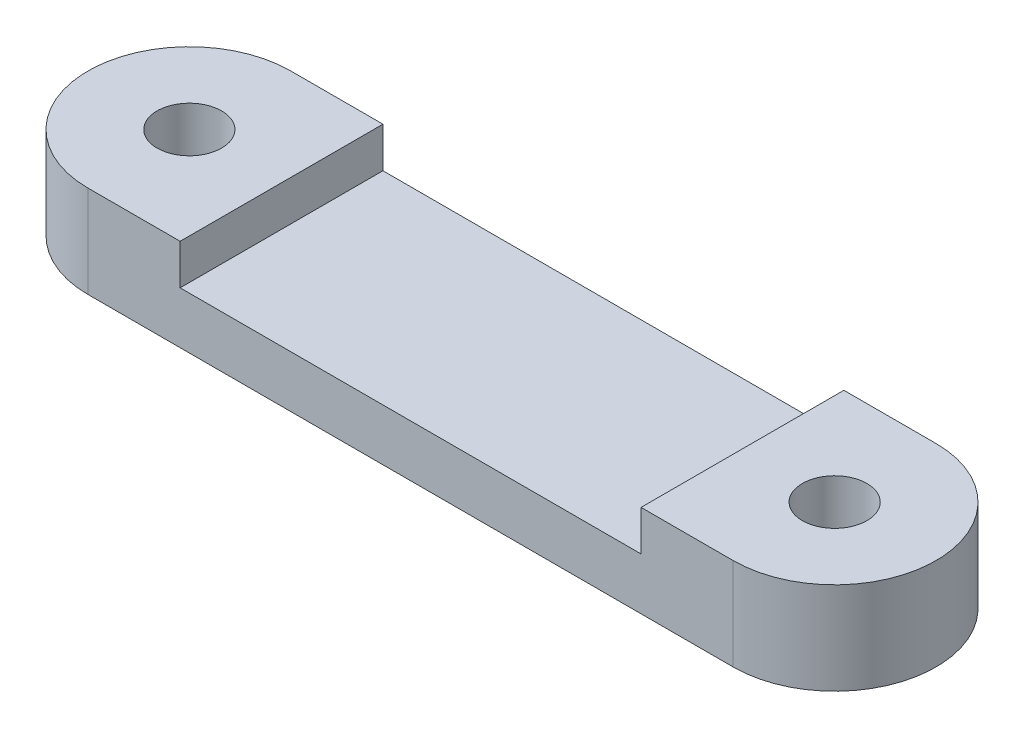
ISO-10303-21;
HEADER;
FILE_DESCRIPTION(('STEP AP214'),'2;1');
FILE_NAME('part.step','',(''),(''),'','','');
FILE_SCHEMA(('AUTOMOTIVE_DESIGN { 1 0 10303 214 1 1 1 1 }'));
ENDSEC;
DATA;
#1=APPLICATION_CONTEXT('core data for automotive mechanical design processes');
#2=APPLICATION_PROTOCOL_DEFINITION('international standard','automotive_design',2000,#1);
#3=PRODUCT_CONTEXT('',#1,'mechanical');
#4=PRODUCT('Part','Part','',(#3));
#5=PRODUCT_RELATED_PRODUCT_CATEGORY('part','',(#4));
#6=PRODUCT_DEFINITION_FORMATION('','',#4);
#7=PRODUCT_DEFINITION_CONTEXT('part definition',#1,'design');
#8=PRODUCT_DEFINITION('design','',#6,#7);
#9=PRODUCT_DEFINITION_SHAPE('','',#8);
#10=(LENGTH_UNIT() NAMED_UNIT(*) SI_UNIT(.MILLI.,.METRE.));
#11=(NAMED_UNIT(*) PLANE_ANGLE_UNIT() SI_UNIT($,.RADIAN.));
#12=(NAMED_UNIT(*) SI_UNIT($,.STERADIAN.) SOLID_ANGLE_UNIT());
#13=UNCERTAINTY_MEASURE_WITH_UNIT(LENGTH_MEASURE(1.E-05),#10,'distance_accuracy_value','');
#14=(GEOMETRIC_REPRESENTATION_CONTEXT(3) GLOBAL_UNCERTAINTY_ASSIGNED_CONTEXT((#13)) GLOBAL_UNIT_ASSIGNED_CONTEXT((#10,
#11,#12)) REPRESENTATION_CONTEXT('',''));
#15=CARTESIAN_POINT('',(0.,0.,0.));
#16=DIRECTION('',(0.,0.,1.));
#17=DIRECTION('',(1.,0.,0.));
#18=AXIS2_PLACEMENT_3D('',#15,#16,#17);
#19=CARTESIAN_POINT('',(0.,4.,-4.4));
#20=DIRECTION('',(0.,1.,0.));
#21=DIRECTION('',(0.,0.,1.));
#22=AXIS2_PLACEMENT_3D('',#19,#20,#21);
#23=PLANE('',#22);
#24=DIRECTION('',(0.,0.,-1.));
#25=VECTOR('',#24,1.);
#26=CARTESIAN_POINT('',(24.,4.,0.));
#27=LINE('',#26,#25);
#28=CARTESIAN_POINT('',(24.,4.,0.));
#29=VERTEX_POINT('',#28);
#30=CARTESIAN_POINT('',(24.,4.,-8.8));
#31=VERTEX_POINT('',#30);
#32=EDGE_CURVE('E186',#29,#31,#27,.T.);
#33=ORIENTED_EDGE('',*,*,#32,.F.);
#34=DIRECTION('',(1.,0.,0.));
#35=VECTOR('',#34,1.);
#36=CARTESIAN_POINT('',(0.,4.,0.));
#37=LINE('',#36,#35);
#38=CARTESIAN_POINT('',(28.,4.,0.));
#39=VERTEX_POINT('',#38);
#40=EDGE_CURVE('E151',#29,#39,#37,.T.);
#41=ORIENTED_EDGE('',*,*,#40,.T.);
#42=CARTESIAN_POINT('',(28.,4.,-4.4));
#43=DIRECTION('',(0.,1.,0.));
#44=DIRECTION('',(0.,0.,-1.));
#45=AXIS2_PLACEMENT_3D('',#42,#43,#44);
#46=CIRCLE('',#45,4.4);
#47=CARTESIAN_POINT('',(28.,4.,-8.8));
#48=VERTEX_POINT('',#47);
#49=EDGE_CURVE('E153',#39,#48,#46,.T.);
#50=ORIENTED_EDGE('',*,*,#49,.T.);
#51=DIRECTION('',(-1.,0.,0.));
#52=VECTOR('',#51,1.);
#53=CARTESIAN_POINT('',(0.,4.,-8.8));
#54=LINE('',#53,#52);
#55=EDGE_CURVE('E155',#48,#31,#54,.T.);
#56=ORIENTED_EDGE('',*,*,#55,.T.);
#57=EDGE_LOOP('',(#33,#41,#50,#56));
#58=FACE_BOUND('',#57,.T.);
#59=CARTESIAN_POINT('',(28.,4.,-4.4));
#60=DIRECTION('',(0.,1.,0.));
#61=DIRECTION('',(0.,0.,1.));
#62=AXIS2_PLACEMENT_3D('',#59,#60,#61);
#63=CIRCLE('',#62,1.4);
#64=CARTESIAN_POINT('',(28.,4.,-3.));
#65=VERTEX_POINT('',#64);
#66=EDGE_CURVE('E136',#65,#65,#63,.T.);
#67=ORIENTED_EDGE('',*,*,#66,.F.);
#68=EDGE_LOOP('',(#67));
#69=FACE_BOUND('',#68,.T.);
#70=ADVANCED_FACE('F39',(#58,#69),#23,.T.);
#71=DIRECTION('',(0.,0.,1.));
#72=VECTOR('',#71,1.);
#73=CARTESIAN_POINT('',(4.,4.,0.));
#74=LINE('',#73,#72);
#75=CARTESIAN_POINT('',(4.,4.,-8.8));
#76=VERTEX_POINT('',#75);
#77=CARTESIAN_POINT('',(4.,4.,0.));
#78=VERTEX_POINT('',#77);
#79=EDGE_CURVE('E185',#76,#78,#74,.T.);
#80=ORIENTED_EDGE('',*,*,#79,.F.);
#81=CARTESIAN_POINT('',(0.,4.,-8.8));
#82=VERTEX_POINT('',#81);
#83=EDGE_CURVE('E63',#76,#82,#54,.T.);
#84=ORIENTED_EDGE('',*,*,#83,.T.);
#85=CARTESIAN_POINT('',(0.,4.,-4.4));
#86=DIRECTION('',(0.,1.,0.));
#87=DIRECTION('',(0.,0.,1.));
#88=AXIS2_PLACEMENT_3D('',#85,#86,#87);
#89=CIRCLE('',#88,4.4);
#90=CARTESIAN_POINT('',(0.,4.,0.));
#91=VERTEX_POINT('',#90);
#92=EDGE_CURVE('E149',#82,#91,#89,.T.);
#93=ORIENTED_EDGE('',*,*,#92,.T.);
#94=EDGE_CURVE('E92',#91,#78,#37,.T.);
#95=ORIENTED_EDGE('',*,*,#94,.T.);
#96=EDGE_LOOP('',(#80,#84,#93,#95));
#97=FACE_BOUND('',#96,.T.);
#98=CARTESIAN_POINT('',(0.,4.,-4.4));
#99=DIRECTION('',(0.,1.,0.));
#100=DIRECTION('',(0.,0.,1.));
#101=AXIS2_PLACEMENT_3D('',#98,#99,#100);
#102=CIRCLE('',#101,1.4);
#103=CARTESIAN_POINT('',(0.,4.,-3.));
#104=VERTEX_POINT('',#103);
#105=EDGE_CURVE('E143',#104,#104,#102,.T.);
#106=ORIENTED_EDGE('',*,*,#105,.F.);
#107=EDGE_LOOP('',(#106));
#108=FACE_BOUND('',#107,.T.);
#109=ADVANCED_FACE('F183',(#97,#108),#23,.T.);
#110=CARTESIAN_POINT('',(0.,0.,-4.4));
#111=DIRECTION('',(0.,1.,0.));
#112=DIRECTION('',(0.,0.,1.));
#113=AXIS2_PLACEMENT_3D('',#110,#111,#112);
#114=PLANE('',#113);
#115=CARTESIAN_POINT('',(0.,0.,-4.4));
#116=DIRECTION('',(0.,1.,0.));
#117=DIRECTION('',(0.,0.,1.));
#118=AXIS2_PLACEMENT_3D('',#115,#116,#117);
#119=CIRCLE('',#118,4.4);
#120=CARTESIAN_POINT('',(0.,0.,-8.8));
#121=VERTEX_POINT('',#120);
#122=CARTESIAN_POINT('',(0.,0.,0.));
#123=VERTEX_POINT('',#122);
#124=EDGE_CURVE('E146',#121,#123,#119,.T.);
#125=ORIENTED_EDGE('',*,*,#124,.F.);
#126=DIRECTION('',(-1.,0.,0.));
#127=VECTOR('',#126,1.);
#128=CARTESIAN_POINT('',(0.,0.,-8.8));
#129=LINE('',#128,#127);
#130=CARTESIAN_POINT('',(28.,0.,-8.8));
#131=VERTEX_POINT('',#130);
#132=EDGE_CURVE('E85',#131,#121,#129,.T.);
#133=ORIENTED_EDGE('',*,*,#132,.F.);
#134=CARTESIAN_POINT('',(28.,0.,-4.4));
#135=DIRECTION('',(0.,1.,0.));
#136=DIRECTION('',(0.,0.,-1.));
#137=AXIS2_PLACEMENT_3D('',#134,#135,#136);
#138=CIRCLE('',#137,4.4);
#139=CARTESIAN_POINT('',(28.,0.,0.));
#140=VERTEX_POINT('',#139);
#141=EDGE_CURVE('E163',#140,#131,#138,.T.);
#142=ORIENTED_EDGE('',*,*,#141,.F.);
#143=DIRECTION('',(1.,0.,0.));
#144=VECTOR('',#143,1.);
#145=CARTESIAN_POINT('',(0.,0.,0.));
#146=LINE('',#145,#144);
#147=EDGE_CURVE('E161',#123,#140,#146,.T.);
#148=ORIENTED_EDGE('',*,*,#147,.F.);
#149=EDGE_LOOP('',(#125,#133,#142,#148));
#150=FACE_BOUND('',#149,.T.);
#151=CARTESIAN_POINT('',(0.,0.,-4.4));
#152=DIRECTION('',(0.,1.,0.));
#153=DIRECTION('',(0.,0.,1.));
#154=AXIS2_PLACEMENT_3D('',#151,#152,#153);
#155=CIRCLE('',#154,1.4);
#156=CARTESIAN_POINT('',(0.,0.,-3.));
#157=VERTEX_POINT('',#156);
#158=EDGE_CURVE('E139',#157,#157,#155,.T.);
#159=ORIENTED_EDGE('',*,*,#158,.T.);
#160=EDGE_LOOP('',(#159));
#161=FACE_BOUND('',#160,.T.);
#162=CARTESIAN_POINT('',(28.,0.,-4.4));
#163=DIRECTION('',(0.,1.,0.));
#164=DIRECTION('',(0.,0.,1.));
#165=AXIS2_PLACEMENT_3D('',#162,#163,#164);
#166=CIRCLE('',#165,1.4);
#167=CARTESIAN_POINT('',(28.,0.,-3.));
#168=VERTEX_POINT('',#167);
#169=EDGE_CURVE('E140',#168,#168,#166,.T.);
#170=ORIENTED_EDGE('',*,*,#169,.T.);
#171=EDGE_LOOP('',(#170));
#172=FACE_BOUND('',#171,.T.);
#173=ADVANCED_FACE('F178',(#150,#161,#172),#114,.F.);
#174=CARTESIAN_POINT('',(0.,4.,-4.4));
#175=DIRECTION('',(0.,-1.,0.));
#176=DIRECTION('',(0.,0.,-1.));
#177=AXIS2_PLACEMENT_3D('',#174,#175,#176);
#178=CYLINDRICAL_SURFACE('',#177,4.4);
#179=ORIENTED_EDGE('',*,*,#124,.T.);
#180=DIRECTION('',(0.,-1.,0.));
#181=VECTOR('',#180,1.);
#182=CARTESIAN_POINT('',(0.,4.,0.));
#183=LINE('',#182,#181);
#184=EDGE_CURVE('E11',#91,#123,#183,.T.);
#185=ORIENTED_EDGE('',*,*,#184,.F.);
#186=ORIENTED_EDGE('',*,*,#92,.F.);
#187=DIRECTION('',(0.,-1.,0.));
#188=VECTOR('',#187,1.);
#189=CARTESIAN_POINT('',(0.,4.,-8.8));
#190=LINE('',#189,#188);
#191=EDGE_CURVE('E158',#82,#121,#190,.T.);
#192=ORIENTED_EDGE('',*,*,#191,.T.);
#193=EDGE_LOOP('',(#179,#185,#186,#192));
#194=FACE_BOUND('',#193,.T.);
#195=ADVANCED_FACE('F41',(#194),#178,.T.);
#196=CARTESIAN_POINT('',(0.,4.,0.));
#197=DIRECTION('',(0.,0.,-1.));
#198=DIRECTION('',(-1.,0.,0.));
#199=AXIS2_PLACEMENT_3D('',#196,#197,#198);
#200=PLANE('',#199);
#201=ORIENTED_EDGE('',*,*,#40,.F.);
#202=DIRECTION('',(0.,1.,0.));
#203=VECTOR('',#202,1.);
#204=CARTESIAN_POINT('',(24.,2.25,0.));
#205=LINE('',#204,#203);
#206=CARTESIAN_POINT('',(24.,2.25,0.));
#207=VERTEX_POINT('',#206);
#208=EDGE_CURVE('E131',#207,#29,#205,.T.);
#209=ORIENTED_EDGE('',*,*,#208,.F.);
#210=DIRECTION('',(1.,0.,0.));
#211=VECTOR('',#210,1.);
#212=CARTESIAN_POINT('',(24.,2.25,0.));
#213=LINE('',#212,#211);
#214=CARTESIAN_POINT('',(4.,2.25,0.));
#215=VERTEX_POINT('',#214);
#216=EDGE_CURVE('E121',#215,#207,#213,.T.);
#217=ORIENTED_EDGE('',*,*,#216,.F.);
#218=DIRECTION('',(0.,1.,0.));
#219=VECTOR('',#218,1.);
#220=CARTESIAN_POINT('',(4.,2.25,0.));
#221=LINE('',#220,#219);
#222=EDGE_CURVE('E119',#215,#78,#221,.T.);
#223=ORIENTED_EDGE('',*,*,#222,.T.);
#224=ORIENTED_EDGE('',*,*,#94,.F.);
#225=ORIENTED_EDGE('',*,*,#184,.T.);
#226=ORIENTED_EDGE('',*,*,#147,.T.);
#227=DIRECTION('',(0.,-1.,0.));
#228=VECTOR('',#227,1.);
#229=CARTESIAN_POINT('',(28.,4.,0.));
#230=LINE('',#229,#228);
#231=EDGE_CURVE('E47',#39,#140,#230,.T.);
#232=ORIENTED_EDGE('',*,*,#231,.F.);
#233=EDGE_LOOP('',(#201,#209,#217,#223,#224,#225,#226,#232));
#234=FACE_BOUND('',#233,.T.);
#235=ADVANCED_FACE('F198',(#234),#200,.F.);
#236=CARTESIAN_POINT('',(28.,4.,-4.4));
#237=DIRECTION('',(0.,-1.,0.));
#238=DIRECTION('',(0.,0.,-1.));
#239=AXIS2_PLACEMENT_3D('',#236,#237,#238);
#240=CYLINDRICAL_SURFACE('',#239,4.4);
#241=ORIENTED_EDGE('',*,*,#141,.T.);
#242=DIRECTION('',(0.,-1.,0.));
#243=VECTOR('',#242,1.);
#244=CARTESIAN_POINT('',(28.,4.,-8.8));
#245=LINE('',#244,#243);
#246=EDGE_CURVE('E167',#48,#131,#245,.T.);
#247=ORIENTED_EDGE('',*,*,#246,.F.);
#248=ORIENTED_EDGE('',*,*,#49,.F.);
#249=ORIENTED_EDGE('',*,*,#231,.T.);
#250=EDGE_LOOP('',(#241,#247,#248,#249));
#251=FACE_BOUND('',#250,.T.);
#252=ADVANCED_FACE('F173',(#251),#240,.T.);
#253=CARTESIAN_POINT('',(0.,4.,-8.8));
#254=DIRECTION('',(0.,0.,1.));
#255=DIRECTION('',(1.,0.,0.));
#256=AXIS2_PLACEMENT_3D('',#253,#254,#255);
#257=PLANE('',#256);
#258=DIRECTION('',(-1.,0.,0.));
#259=VECTOR('',#258,1.);
#260=CARTESIAN_POINT('',(24.,2.25,-8.8));
#261=LINE('',#260,#259);
#262=CARTESIAN_POINT('',(24.,2.25,-8.8));
#263=VERTEX_POINT('',#262);
#264=CARTESIAN_POINT('',(4.,2.25,-8.8));
#265=VERTEX_POINT('',#264);
#266=EDGE_CURVE('E122',#263,#265,#261,.T.);
#267=ORIENTED_EDGE('',*,*,#266,.F.);
#268=DIRECTION('',(0.,1.,0.));
#269=VECTOR('',#268,1.);
#270=CARTESIAN_POINT('',(24.,2.25,-8.8));
#271=LINE('',#270,#269);
#272=EDGE_CURVE('E129',#263,#31,#271,.T.);
#273=ORIENTED_EDGE('',*,*,#272,.T.);
#274=ORIENTED_EDGE('',*,*,#55,.F.);
#275=ORIENTED_EDGE('',*,*,#246,.T.);
#276=ORIENTED_EDGE('',*,*,#132,.T.);
#277=ORIENTED_EDGE('',*,*,#191,.F.);
#278=ORIENTED_EDGE('',*,*,#83,.F.);
#279=DIRECTION('',(0.,1.,0.));
#280=VECTOR('',#279,1.);
#281=CARTESIAN_POINT('',(4.,2.25,-8.8));
#282=LINE('',#281,#280);
#283=EDGE_CURVE('E118',#265,#76,#282,.T.);
#284=ORIENTED_EDGE('',*,*,#283,.F.);
#285=EDGE_LOOP('',(#267,#273,#274,#275,#276,#277,#278,#284));
#286=FACE_BOUND('',#285,.T.);
#287=ADVANCED_FACE('F128',(#286),#257,.F.);
#288=CARTESIAN_POINT('',(0.,4.,-4.4));
#289=DIRECTION('',(0.,-1.,0.));
#290=DIRECTION('',(0.,0.,-1.));
#291=AXIS2_PLACEMENT_3D('',#288,#289,#290);
#292=CYLINDRICAL_SURFACE('',#291,1.4);
#293=ORIENTED_EDGE('',*,*,#105,.T.);
#294=EDGE_LOOP('',(#293));
#295=FACE_BOUND('',#294,.T.);
#296=ORIENTED_EDGE('',*,*,#158,.F.);
#297=EDGE_LOOP('',(#296));
#298=FACE_BOUND('',#297,.T.);
#299=ADVANCED_FACE('F214',(#295,#298),#292,.F.);
#300=CARTESIAN_POINT('',(28.,4.,-4.4));
#301=DIRECTION('',(0.,-1.,0.));
#302=DIRECTION('',(0.,0.,-1.));
#303=AXIS2_PLACEMENT_3D('',#300,#301,#302);
#304=CYLINDRICAL_SURFACE('',#303,1.4);
#305=ORIENTED_EDGE('',*,*,#66,.T.);
#306=EDGE_LOOP('',(#305));
#307=FACE_BOUND('',#306,.T.);
#308=ORIENTED_EDGE('',*,*,#169,.F.);
#309=EDGE_LOOP('',(#308));
#310=FACE_BOUND('',#309,.T.);
#311=ADVANCED_FACE('F222',(#307,#310),#304,.F.);
#312=CARTESIAN_POINT('',(24.,2.25,0.));
#313=DIRECTION('',(1.,0.,0.));
#314=DIRECTION('',(0.,0.,-1.));
#315=AXIS2_PLACEMENT_3D('',#312,#313,#314);
#316=PLANE('',#315);
#317=ORIENTED_EDGE('',*,*,#32,.T.);
#318=ORIENTED_EDGE('',*,*,#272,.F.);
#319=DIRECTION('',(0.,0.,-1.));
#320=VECTOR('',#319,1.);
#321=CARTESIAN_POINT('',(24.,2.25,0.));
#322=LINE('',#321,#320);
#323=EDGE_CURVE('E54',#207,#263,#322,.T.);
#324=ORIENTED_EDGE('',*,*,#323,.F.);
#325=ORIENTED_EDGE('',*,*,#208,.T.);
#326=EDGE_LOOP('',(#317,#318,#324,#325));
#327=FACE_BOUND('',#326,.T.);
#328=ADVANCED_FACE('F194',(#327),#316,.F.);
#329=CARTESIAN_POINT('',(4.,2.25,0.));
#330=DIRECTION('',(-1.,0.,0.));
#331=DIRECTION('',(0.,0.,1.));
#332=AXIS2_PLACEMENT_3D('',#329,#330,#331);
#333=PLANE('',#332);
#334=ORIENTED_EDGE('',*,*,#79,.T.);
#335=ORIENTED_EDGE('',*,*,#222,.F.);
#336=DIRECTION('',(0.,0.,1.));
#337=VECTOR('',#336,1.);
#338=CARTESIAN_POINT('',(4.,2.25,0.));
#339=LINE('',#338,#337);
#340=EDGE_CURVE('E115',#265,#215,#339,.T.);
#341=ORIENTED_EDGE('',*,*,#340,.F.);
#342=ORIENTED_EDGE('',*,*,#283,.T.);
#343=EDGE_LOOP('',(#334,#335,#341,#342));
#344=FACE_BOUND('',#343,.T.);
#345=ADVANCED_FACE('F116',(#344),#333,.F.);
#346=CARTESIAN_POINT('',(0.,2.25,0.));
#347=DIRECTION('',(0.,1.,0.));
#348=DIRECTION('',(0.,0.,1.));
#349=AXIS2_PLACEMENT_3D('',#346,#347,#348);
#350=PLANE('',#349);
#351=ORIENTED_EDGE('',*,*,#323,.T.);
#352=ORIENTED_EDGE('',*,*,#266,.T.);
#353=ORIENTED_EDGE('',*,*,#340,.T.);
#354=ORIENTED_EDGE('',*,*,#216,.T.);
#355=EDGE_LOOP('',(#351,#352,#353,#354));
#356=FACE_BOUND('',#355,.T.);
#357=ADVANCED_FACE('F125',(#356),#350,.T.);
#358=CLOSED_SHELL('',(#70,#109,#173,#195,#235,#252,#287,#299,#311,#328,#345,#357));
#359=MANIFOLD_SOLID_BREP('B2',#358);
#360=ADVANCED_BREP_SHAPE_REPRESENTATION('',(#18,#359),#14);
#361=SHAPE_DEFINITION_REPRESENTATION(#9,#360);
ENDSEC;
END-ISO-10303-21;
